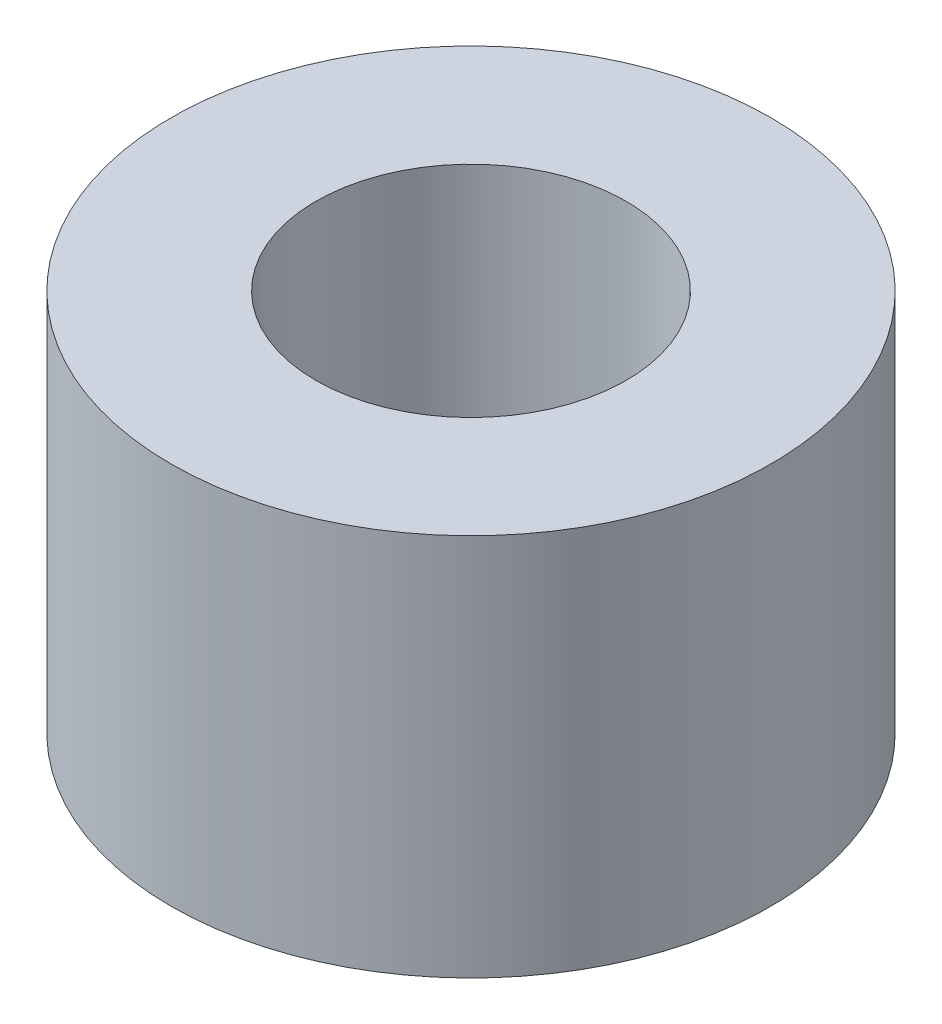
ISO-10303-21;
HEADER;
FILE_DESCRIPTION(('STEP AP214'),'2;1');
FILE_NAME('part.step','',(''),(''),'','','');
FILE_SCHEMA(('AUTOMOTIVE_DESIGN { 1 0 10303 214 1 1 1 1 }'));
ENDSEC;
DATA;
#1=APPLICATION_CONTEXT('core data for automotive mechanical design processes');
#2=APPLICATION_PROTOCOL_DEFINITION('international standard','automotive_design',2000,#1);
#3=PRODUCT_CONTEXT('',#1,'mechanical');
#4=PRODUCT('Part','Part','',(#3));
#5=PRODUCT_RELATED_PRODUCT_CATEGORY('part','',(#4));
#6=PRODUCT_DEFINITION_FORMATION('','',#4);
#7=PRODUCT_DEFINITION_CONTEXT('part definition',#1,'design');
#8=PRODUCT_DEFINITION('design','',#6,#7);
#9=PRODUCT_DEFINITION_SHAPE('','',#8);
#10=(LENGTH_UNIT() NAMED_UNIT(*) SI_UNIT(.MILLI.,.METRE.));
#11=(NAMED_UNIT(*) PLANE_ANGLE_UNIT() SI_UNIT($,.RADIAN.));
#12=(NAMED_UNIT(*) SI_UNIT($,.STERADIAN.) SOLID_ANGLE_UNIT());
#13=UNCERTAINTY_MEASURE_WITH_UNIT(LENGTH_MEASURE(1.E-05),#10,'distance_accuracy_value','');
#14=(GEOMETRIC_REPRESENTATION_CONTEXT(3) GLOBAL_UNCERTAINTY_ASSIGNED_CONTEXT((#13)) GLOBAL_UNIT_ASSIGNED_CONTEXT((#10,
#11,#12)) REPRESENTATION_CONTEXT('',''));
#15=CARTESIAN_POINT('',(0.,0.,0.));
#16=DIRECTION('',(0.,0.,1.));
#17=DIRECTION('',(1.,0.,0.));
#18=AXIS2_PLACEMENT_3D('',#15,#16,#17);
#19=CARTESIAN_POINT('',(0.,19.1558080512951,0.));
#20=DIRECTION('',(0.,-1.,0.));
#21=DIRECTION('',(0.,0.,-1.));
#22=AXIS2_PLACEMENT_3D('',#19,#20,#21);
#23=CYLINDRICAL_SURFACE('',#22,15.);
#24=CARTESIAN_POINT('',(0.,19.1558080512951,0.));
#25=DIRECTION('',(0.,1.,0.));
#26=DIRECTION('',(0.,0.,1.));
#27=AXIS2_PLACEMENT_3D('',#24,#25,#26);
#28=CIRCLE('',#27,15.);
#29=CARTESIAN_POINT('',(0.,19.1558080512951,15.));
#30=VERTEX_POINT('',#29);
#31=EDGE_CURVE('E10',#30,#30,#28,.T.);
#32=ORIENTED_EDGE('',*,*,#31,.F.);
#33=EDGE_LOOP('',(#32));
#34=FACE_BOUND('',#33,.T.);
#35=CARTESIAN_POINT('',(0.,0.,0.));
#36=DIRECTION('',(0.,1.,0.));
#37=DIRECTION('',(0.,0.,1.));
#38=AXIS2_PLACEMENT_3D('',#35,#36,#37);
#39=CIRCLE('',#38,15.);
#40=CARTESIAN_POINT('',(0.,0.,15.));
#41=VERTEX_POINT('',#40);
#42=EDGE_CURVE('E37',#41,#41,#39,.T.);
#43=ORIENTED_EDGE('',*,*,#42,.T.);
#44=EDGE_LOOP('',(#43));
#45=FACE_BOUND('',#44,.T.);
#46=ADVANCED_FACE('F40',(#34,#45),#23,.T.);
#47=CARTESIAN_POINT('',(0.,19.1558080512951,0.));
#48=DIRECTION('',(0.,1.,0.));
#49=DIRECTION('',(0.,0.,1.));
#50=AXIS2_PLACEMENT_3D('',#47,#48,#49);
#51=PLANE('',#50);
#52=CARTESIAN_POINT('',(0.,19.1558080512951,0.));
#53=DIRECTION('',(0.,1.,0.));
#54=DIRECTION('',(0.,0.,1.));
#55=AXIS2_PLACEMENT_3D('',#52,#53,#54);
#56=CIRCLE('',#55,7.76066192512777);
#57=CARTESIAN_POINT('',(0.,19.1558080512951,7.76066192512777));
#58=VERTEX_POINT('',#57);
#59=EDGE_CURVE('E50',#58,#58,#56,.T.);
#60=ORIENTED_EDGE('',*,*,#59,.F.);
#61=EDGE_LOOP('',(#60));
#62=FACE_BOUND('',#61,.T.);
#63=ORIENTED_EDGE('',*,*,#31,.T.);
#64=EDGE_LOOP('',(#63));
#65=FACE_BOUND('',#64,.T.);
#66=ADVANCED_FACE('F59',(#62,#65),#51,.T.);
#67=CARTESIAN_POINT('',(0.,0.,0.));
#68=DIRECTION('',(0.,1.,0.));
#69=DIRECTION('',(0.,0.,1.));
#70=AXIS2_PLACEMENT_3D('',#67,#68,#69);
#71=PLANE('',#70);
#72=CARTESIAN_POINT('',(0.,0.,0.));
#73=DIRECTION('',(0.,1.,0.));
#74=DIRECTION('',(0.,0.,1.));
#75=AXIS2_PLACEMENT_3D('',#72,#73,#74);
#76=CIRCLE('',#75,7.76066192512777);
#77=CARTESIAN_POINT('',(0.,0.,7.76066192512777));
#78=VERTEX_POINT('',#77);
#79=EDGE_CURVE('E47',#78,#78,#76,.T.);
#80=ORIENTED_EDGE('',*,*,#79,.T.);
#81=EDGE_LOOP('',(#80));
#82=FACE_BOUND('',#81,.T.);
#83=ORIENTED_EDGE('',*,*,#42,.F.);
#84=EDGE_LOOP('',(#83));
#85=FACE_BOUND('',#84,.T.);
#86=ADVANCED_FACE('F58',(#82,#85),#71,.F.);
#87=CARTESIAN_POINT('',(0.,19.1558080512951,0.));
#88=DIRECTION('',(0.,-1.,0.));
#89=DIRECTION('',(0.,0.,-1.));
#90=AXIS2_PLACEMENT_3D('',#87,#88,#89);
#91=CYLINDRICAL_SURFACE('',#90,7.76066192512777);
#92=ORIENTED_EDGE('',*,*,#59,.T.);
#93=EDGE_LOOP('',(#92));
#94=FACE_BOUND('',#93,.T.);
#95=ORIENTED_EDGE('',*,*,#79,.F.);
#96=EDGE_LOOP('',(#95));
#97=FACE_BOUND('',#96,.T.);
#98=ADVANCED_FACE('F54',(#94,#97),#91,.F.);
#99=CLOSED_SHELL('',(#46,#66,#86,#98));
#100=MANIFOLD_SOLID_BREP('B2',#99);
#101=ADVANCED_BREP_SHAPE_REPRESENTATION('',(#18,#100),#14);
#102=SHAPE_DEFINITION_REPRESENTATION(#9,#101);
ENDSEC;
END-ISO-10303-21;
